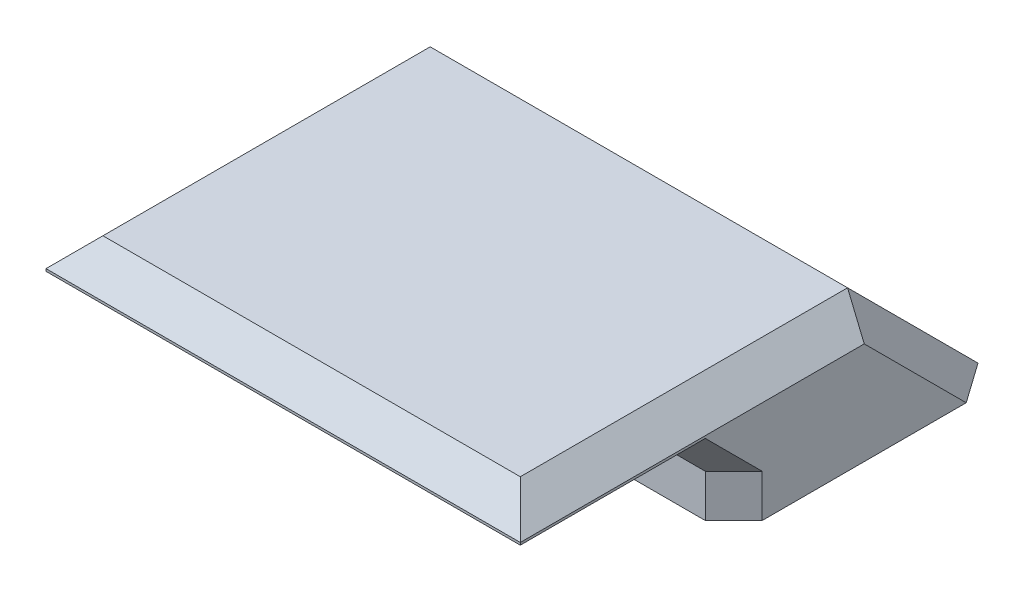
ISO-10303-21;
HEADER;
FILE_DESCRIPTION(('STEP AP214'),'2;1');
FILE_NAME('part.step','',(''),(''),'','','');
FILE_SCHEMA(('AUTOMOTIVE_DESIGN { 1 0 10303 214 1 1 1 1 }'));
ENDSEC;
DATA;
#1=APPLICATION_CONTEXT('core data for automotive mechanical design processes');
#2=APPLICATION_PROTOCOL_DEFINITION('international standard','automotive_design',2000,#1);
#3=PRODUCT_CONTEXT('',#1,'mechanical');
#4=PRODUCT('Part','Part','',(#3));
#5=PRODUCT_RELATED_PRODUCT_CATEGORY('part','',(#4));
#6=PRODUCT_DEFINITION_FORMATION('','',#4);
#7=PRODUCT_DEFINITION_CONTEXT('part definition',#1,'design');
#8=PRODUCT_DEFINITION('design','',#6,#7);
#9=PRODUCT_DEFINITION_SHAPE('','',#8);
#10=(LENGTH_UNIT() NAMED_UNIT(*) SI_UNIT(.MILLI.,.METRE.));
#11=(NAMED_UNIT(*) PLANE_ANGLE_UNIT() SI_UNIT($,.RADIAN.));
#12=(NAMED_UNIT(*) SI_UNIT($,.STERADIAN.) SOLID_ANGLE_UNIT());
#13=UNCERTAINTY_MEASURE_WITH_UNIT(LENGTH_MEASURE(1.E-05),#10,'distance_accuracy_value','');
#14=(GEOMETRIC_REPRESENTATION_CONTEXT(3) GLOBAL_UNCERTAINTY_ASSIGNED_CONTEXT((#13)) GLOBAL_UNIT_ASSIGNED_CONTEXT((#10,
#11,#12)) REPRESENTATION_CONTEXT('',''));
#15=CARTESIAN_POINT('',(0.,0.,0.));
#16=DIRECTION('',(0.,0.,1.));
#17=DIRECTION('',(1.,0.,0.));
#18=AXIS2_PLACEMENT_3D('',#15,#16,#17);
#19=CARTESIAN_POINT('',(-10.,3.,-3.));
#20=DIRECTION('',(1.,0.,0.));
#21=DIRECTION('',(0.,0.,-1.));
#22=AXIS2_PLACEMENT_3D('',#19,#20,#21);
#23=PLANE('',#22);
#24=DIRECTION('',(0.,0.,1.));
#25=VECTOR('',#24,1.);
#26=CARTESIAN_POINT('',(-10.,0.,-3.));
#27=LINE('',#26,#25);
#28=CARTESIAN_POINT('',(-10.,0.,-6.80294372515228));
#29=VERTEX_POINT('',#28);
#30=CARTESIAN_POINT('',(-9.99999999999999,0.,1.8));
#31=VERTEX_POINT('',#30);
#32=EDGE_CURVE('E341',#29,#31,#27,.T.);
#33=ORIENTED_EDGE('',*,*,#32,.T.);
#34=DIRECTION('',(0.,1.,0.));
#35=VECTOR('',#34,1.);
#36=CARTESIAN_POINT('',(-9.99999999999999,3.,1.8));
#37=LINE('',#36,#35);
#38=CARTESIAN_POINT('',(-9.99999999999999,1.8,1.8));
#39=VERTEX_POINT('',#38);
#40=EDGE_CURVE('E212',#31,#39,#37,.T.);
#41=ORIENTED_EDGE('',*,*,#40,.T.);
#42=DIRECTION('',(0.,-0.707106781186547,-0.707106781186548));
#43=VECTOR('',#42,1.);
#44=CARTESIAN_POINT('',(-9.99999999999999,1.8,1.8));
#45=LINE('',#44,#43);
#46=CARTESIAN_POINT('',(-9.99999999999999,3.,3.));
#47=VERTEX_POINT('',#46);
#48=EDGE_CURVE('E208',#47,#39,#45,.T.);
#49=ORIENTED_EDGE('',*,*,#48,.F.);
#50=DIRECTION('',(0.,-0.707106781186547,-0.707106781186548));
#51=VECTOR('',#50,1.);
#52=CARTESIAN_POINT('',(-9.99999999999999,1.8,1.8));
#53=LINE('',#52,#51);
#54=CARTESIAN_POINT('',(-9.99999999999999,4.2,4.2));
#55=VERTEX_POINT('',#54);
#56=EDGE_CURVE('E204',#55,#47,#53,.T.);
#57=ORIENTED_EDGE('',*,*,#56,.F.);
#58=DIRECTION('',(0.,0.,1.));
#59=VECTOR('',#58,1.);
#60=CARTESIAN_POINT('',(-10.,4.2,-3.));
#61=LINE('',#60,#59);
#62=CARTESIAN_POINT('',(-9.99999999999999,4.2,12.));
#63=VERTEX_POINT('',#62);
#64=EDGE_CURVE('E201',#55,#63,#61,.T.);
#65=ORIENTED_EDGE('',*,*,#64,.T.);
#66=DIRECTION('',(0.,-1.,0.));
#67=VECTOR('',#66,1.);
#68=CARTESIAN_POINT('',(-9.99999999999999,5.5,12.));
#69=LINE('',#68,#67);
#70=CARTESIAN_POINT('',(-9.99999999999999,4.3,12.));
#71=VERTEX_POINT('',#70);
#72=EDGE_CURVE('E318',#71,#63,#69,.T.);
#73=ORIENTED_EDGE('',*,*,#72,.F.);
#74=DIRECTION('',(0.,0.,-1.));
#75=VECTOR('',#74,1.);
#76=CARTESIAN_POINT('',(-10.,4.3,-3.));
#77=LINE('',#76,#75);
#78=CARTESIAN_POINT('',(-10.,4.3,-2.50294372515229));
#79=VERTEX_POINT('',#78);
#80=EDGE_CURVE('E194',#71,#79,#77,.T.);
#81=ORIENTED_EDGE('',*,*,#80,.T.);
#82=DIRECTION('',(0.,-0.707106781186548,-0.707106781186548));
#83=VECTOR('',#82,1.);
#84=CARTESIAN_POINT('',(-10.,-0.848528137423856,-7.65147186257614));
#85=LINE('',#84,#83);
#86=EDGE_CURVE('E197',#79,#29,#85,.T.);
#87=ORIENTED_EDGE('',*,*,#86,.T.);
#88=EDGE_LOOP('',(#33,#41,#49,#57,#65,#73,#81,#87));
#89=FACE_BOUND('',#88,.T.);
#90=ADVANCED_FACE('F39',(#89),#23,.F.);
#91=CARTESIAN_POINT('',(0.,0.,0.));
#92=DIRECTION('',(0.,1.,0.));
#93=DIRECTION('',(0.,0.,1.));
#94=AXIS2_PLACEMENT_3D('',#91,#92,#93);
#95=PLANE('',#94);
#96=DIRECTION('',(0.,0.,-1.));
#97=VECTOR('',#96,1.);
#98=CARTESIAN_POINT('',(10.,0.,-3.));
#99=LINE('',#98,#97);
#100=CARTESIAN_POINT('',(10.,0.,1.8));
#101=VERTEX_POINT('',#100);
#102=CARTESIAN_POINT('',(10.,0.,-6.80294372515228));
#103=VERTEX_POINT('',#102);
#104=EDGE_CURVE('E338',#101,#103,#99,.T.);
#105=ORIENTED_EDGE('',*,*,#104,.F.);
#106=DIRECTION('',(0.707106781186548,0.,-0.707106781186547));
#107=VECTOR('',#106,1.);
#108=CARTESIAN_POINT('',(10.,0.,1.8));
#109=LINE('',#108,#107);
#110=CARTESIAN_POINT('',(8.8,0.,3.));
#111=VERTEX_POINT('',#110);
#112=EDGE_CURVE('E182',#101,#111,#109,.F.);
#113=ORIENTED_EDGE('',*,*,#112,.T.);
#114=DIRECTION('',(1.,0.,0.));
#115=VECTOR('',#114,1.);
#116=CARTESIAN_POINT('',(-9.99999999999999,0.,3.));
#117=LINE('',#116,#115);
#118=CARTESIAN_POINT('',(-8.8,0.,3.));
#119=VERTEX_POINT('',#118);
#120=EDGE_CURVE('E345',#119,#111,#117,.T.);
#121=ORIENTED_EDGE('',*,*,#120,.F.);
#122=DIRECTION('',(0.707106781186548,0.,0.707106781186548));
#123=VECTOR('',#122,1.);
#124=CARTESIAN_POINT('',(-8.8,0.,3.));
#125=LINE('',#124,#123);
#126=EDGE_CURVE('E179',#119,#31,#125,.F.);
#127=ORIENTED_EDGE('',*,*,#126,.T.);
#128=ORIENTED_EDGE('',*,*,#32,.F.);
#129=DIRECTION('',(0.577350269189627,0.,-0.816496580927725));
#130=VECTOR('',#129,1.);
#131=CARTESIAN_POINT('',(-11.6034692133619,0.,-4.5352958167682));
#132=LINE('',#131,#130);
#133=CARTESIAN_POINT('',(-8.8,0.,-8.5));
#134=VERTEX_POINT('',#133);
#135=EDGE_CURVE('E176',#29,#134,#132,.T.);
#136=ORIENTED_EDGE('',*,*,#135,.T.);
#137=DIRECTION('',(-1.,0.,0.));
#138=VECTOR('',#137,1.);
#139=CARTESIAN_POINT('',(10.,0.,-8.5));
#140=LINE('',#139,#138);
#141=CARTESIAN_POINT('',(8.8,0.,-8.5));
#142=VERTEX_POINT('',#141);
#143=EDGE_CURVE('E272',#142,#134,#140,.T.);
#144=ORIENTED_EDGE('',*,*,#143,.F.);
#145=DIRECTION('',(0.577350269189624,0.,0.816496580927727));
#146=VECTOR('',#145,1.);
#147=CARTESIAN_POINT('',(11.3927248643507,0.,-4.83333333333333));
#148=LINE('',#147,#146);
#149=EDGE_CURVE('E173',#142,#103,#148,.T.);
#150=ORIENTED_EDGE('',*,*,#149,.T.);
#151=EDGE_LOOP('',(#105,#113,#121,#127,#128,#136,#144,#150));
#152=FACE_BOUND('',#151,.T.);
#153=CARTESIAN_POINT('',(-6.99999999999999,0.,0.));
#154=DIRECTION('',(0.,1.,0.));
#155=DIRECTION('',(0.,0.,1.));
#156=AXIS2_PLACEMENT_3D('',#153,#154,#155);
#157=CIRCLE('',#156,1.4);
#158=CARTESIAN_POINT('',(-6.99999999999999,0.,1.4));
#159=VERTEX_POINT('',#158);
#160=EDGE_CURVE('E331',#159,#159,#157,.T.);
#161=ORIENTED_EDGE('',*,*,#160,.T.);
#162=EDGE_LOOP('',(#161));
#163=FACE_BOUND('',#162,.T.);
#164=CARTESIAN_POINT('',(7.,0.,0.));
#165=DIRECTION('',(0.,1.,0.));
#166=DIRECTION('',(0.,0.,-1.));
#167=AXIS2_PLACEMENT_3D('',#164,#165,#166);
#168=CIRCLE('',#167,1.4);
#169=CARTESIAN_POINT('',(7.,0.,-1.4));
#170=VERTEX_POINT('',#169);
#171=EDGE_CURVE('E327',#170,#170,#168,.T.);
#172=ORIENTED_EDGE('',*,*,#171,.T.);
#173=EDGE_LOOP('',(#172));
#174=FACE_BOUND('',#173,.T.);
#175=ADVANCED_FACE('F306',(#152,#163,#174),#95,.F.);
#176=CARTESIAN_POINT('',(10.,3.,-3.));
#177=DIRECTION('',(-1.,0.,0.));
#178=DIRECTION('',(0.,0.,1.));
#179=AXIS2_PLACEMENT_3D('',#176,#177,#178);
#180=PLANE('',#179);
#181=DIRECTION('',(0.,0.707106781186547,0.707106781186548));
#182=VECTOR('',#181,1.);
#183=CARTESIAN_POINT('',(10.,4.2,4.2));
#184=LINE('',#183,#182);
#185=CARTESIAN_POINT('',(10.,1.8,1.8));
#186=VERTEX_POINT('',#185);
#187=CARTESIAN_POINT('',(10.,3.,3.));
#188=VERTEX_POINT('',#187);
#189=EDGE_CURVE('E148',#186,#188,#184,.T.);
#190=ORIENTED_EDGE('',*,*,#189,.F.);
#191=DIRECTION('',(0.,-1.,0.));
#192=VECTOR('',#191,1.);
#193=CARTESIAN_POINT('',(10.,3.,1.8));
#194=LINE('',#193,#192);
#195=EDGE_CURVE('E167',#186,#101,#194,.T.);
#196=ORIENTED_EDGE('',*,*,#195,.T.);
#197=ORIENTED_EDGE('',*,*,#104,.T.);
#198=DIRECTION('',(0.,0.707106781186548,0.707106781186548));
#199=VECTOR('',#198,1.);
#200=CARTESIAN_POINT('',(10.,4.65147186257614,-2.15147186257614));
#201=LINE('',#200,#199);
#202=CARTESIAN_POINT('',(10.,4.3,-2.50294372515229));
#203=VERTEX_POINT('',#202);
#204=EDGE_CURVE('E157',#103,#203,#201,.T.);
#205=ORIENTED_EDGE('',*,*,#204,.T.);
#206=DIRECTION('',(0.,0.,1.));
#207=VECTOR('',#206,1.);
#208=CARTESIAN_POINT('',(10.,4.3,12.));
#209=LINE('',#208,#207);
#210=CARTESIAN_POINT('',(10.,4.3,12.));
#211=VERTEX_POINT('',#210);
#212=EDGE_CURVE('E292',#203,#211,#209,.T.);
#213=ORIENTED_EDGE('',*,*,#212,.T.);
#214=DIRECTION('',(0.,-1.,0.));
#215=VECTOR('',#214,1.);
#216=CARTESIAN_POINT('',(10.,5.5,12.));
#217=LINE('',#216,#215);
#218=CARTESIAN_POINT('',(10.,4.2,12.));
#219=VERTEX_POINT('',#218);
#220=EDGE_CURVE('E313',#211,#219,#217,.T.);
#221=ORIENTED_EDGE('',*,*,#220,.T.);
#222=DIRECTION('',(0.,0.,-1.));
#223=VECTOR('',#222,1.);
#224=CARTESIAN_POINT('',(10.,4.2,-3.));
#225=LINE('',#224,#223);
#226=CARTESIAN_POINT('',(10.,4.2,4.2));
#227=VERTEX_POINT('',#226);
#228=EDGE_CURVE('E152',#219,#227,#225,.T.);
#229=ORIENTED_EDGE('',*,*,#228,.T.);
#230=DIRECTION('',(0.,0.707106781186547,0.707106781186548));
#231=VECTOR('',#230,1.);
#232=CARTESIAN_POINT('',(10.,4.2,4.2));
#233=LINE('',#232,#231);
#234=EDGE_CURVE('E144',#188,#227,#233,.T.);
#235=ORIENTED_EDGE('',*,*,#234,.F.);
#236=EDGE_LOOP('',(#190,#196,#197,#205,#213,#221,#229,#235));
#237=FACE_BOUND('',#236,.T.);
#238=ADVANCED_FACE('F146',(#237),#180,.F.);
#239=CARTESIAN_POINT('',(-9.99999999999999,3.,3.));
#240=DIRECTION('',(0.,0.,-1.));
#241=DIRECTION('',(-1.,0.,0.));
#242=AXIS2_PLACEMENT_3D('',#239,#240,#241);
#243=PLANE('',#242);
#244=ORIENTED_EDGE('',*,*,#120,.T.);
#245=DIRECTION('',(0.,1.,0.));
#246=VECTOR('',#245,1.);
#247=CARTESIAN_POINT('',(8.8,3.,3.));
#248=LINE('',#247,#246);
#249=CARTESIAN_POINT('',(8.8,1.8,3.));
#250=VERTEX_POINT('',#249);
#251=EDGE_CURVE('E191',#111,#250,#248,.T.);
#252=ORIENTED_EDGE('',*,*,#251,.T.);
#253=DIRECTION('',(-1.,0.,0.));
#254=VECTOR('',#253,1.);
#255=CARTESIAN_POINT('',(-9.99999999999999,1.8,3.));
#256=LINE('',#255,#254);
#257=CARTESIAN_POINT('',(-8.8,1.8,3.));
#258=VERTEX_POINT('',#257);
#259=EDGE_CURVE('E185',#250,#258,#256,.T.);
#260=ORIENTED_EDGE('',*,*,#259,.T.);
#261=DIRECTION('',(0.,-1.,0.));
#262=VECTOR('',#261,1.);
#263=CARTESIAN_POINT('',(-8.8,3.,3.));
#264=LINE('',#263,#262);
#265=EDGE_CURVE('E188',#258,#119,#264,.T.);
#266=ORIENTED_EDGE('',*,*,#265,.T.);
#267=EDGE_LOOP('',(#244,#252,#260,#266));
#268=FACE_BOUND('',#267,.T.);
#269=ADVANCED_FACE('F357',(#268),#243,.F.);
#270=CARTESIAN_POINT('',(-6.99999999999999,3.,0.));
#271=DIRECTION('',(0.,-1.,0.));
#272=DIRECTION('',(0.,0.,-1.));
#273=AXIS2_PLACEMENT_3D('',#270,#271,#272);
#274=CYLINDRICAL_SURFACE('',#273,1.4);
#275=CARTESIAN_POINT('',(-6.99999999999999,3.,0.));
#276=DIRECTION('',(0.,1.,0.));
#277=DIRECTION('',(0.,0.,1.));
#278=AXIS2_PLACEMENT_3D('',#275,#276,#277);
#279=CIRCLE('',#278,1.4);
#280=CARTESIAN_POINT('',(-6.99999999999999,3.,1.4));
#281=VERTEX_POINT('',#280);
#282=EDGE_CURVE('E326',#281,#281,#279,.T.);
#283=ORIENTED_EDGE('',*,*,#282,.T.);
#284=EDGE_LOOP('',(#283));
#285=FACE_BOUND('',#284,.T.);
#286=ORIENTED_EDGE('',*,*,#160,.F.);
#287=EDGE_LOOP('',(#286));
#288=FACE_BOUND('',#287,.T.);
#289=ADVANCED_FACE('F382',(#285,#288),#274,.F.);
#290=CARTESIAN_POINT('',(7.,3.,0.));
#291=DIRECTION('',(0.,-1.,0.));
#292=DIRECTION('',(0.,0.,-1.));
#293=AXIS2_PLACEMENT_3D('',#290,#291,#292);
#294=CYLINDRICAL_SURFACE('',#293,1.4);
#295=CARTESIAN_POINT('',(7.,3.,0.));
#296=DIRECTION('',(0.,1.,0.));
#297=DIRECTION('',(0.,0.,-1.));
#298=AXIS2_PLACEMENT_3D('',#295,#296,#297);
#299=CIRCLE('',#298,1.4);
#300=CARTESIAN_POINT('',(7.,3.,-1.4));
#301=VERTEX_POINT('',#300);
#302=EDGE_CURVE('E322',#301,#301,#299,.T.);
#303=ORIENTED_EDGE('',*,*,#302,.T.);
#304=EDGE_LOOP('',(#303));
#305=FACE_BOUND('',#304,.T.);
#306=ORIENTED_EDGE('',*,*,#171,.F.);
#307=EDGE_LOOP('',(#306));
#308=FACE_BOUND('',#307,.T.);
#309=ADVANCED_FACE('F386',(#305,#308),#294,.F.);
#310=CARTESIAN_POINT('',(0.,3.,0.));
#311=DIRECTION('',(0.,1.,0.));
#312=DIRECTION('',(0.,0.,1.));
#313=AXIS2_PLACEMENT_3D('',#310,#311,#312);
#314=PLANE('',#313);
#315=ORIENTED_EDGE('',*,*,#302,.F.);
#316=EDGE_LOOP('',(#315));
#317=FACE_BOUND('',#316,.T.);
#318=ADVANCED_FACE('F392',(#317),#314,.F.);
#319=DIRECTION('',(1.,0.,0.));
#320=VECTOR('',#319,1.);
#321=CARTESIAN_POINT('',(10.,3.,4.2));
#322=LINE('',#321,#320);
#323=CARTESIAN_POINT('',(-8.8,3.,4.2));
#324=VERTEX_POINT('',#323);
#325=CARTESIAN_POINT('',(8.8,3.,4.2));
#326=VERTEX_POINT('',#325);
#327=EDGE_CURVE('E221',#324,#326,#322,.T.);
#328=ORIENTED_EDGE('',*,*,#327,.T.);
#329=DIRECTION('',(0.,0.,1.));
#330=VECTOR('',#329,1.);
#331=CARTESIAN_POINT('',(8.8,3.,0.));
#332=LINE('',#331,#330);
#333=CARTESIAN_POINT('',(8.8,3.,10.8));
#334=VERTEX_POINT('',#333);
#335=EDGE_CURVE('E224',#326,#334,#332,.T.);
#336=ORIENTED_EDGE('',*,*,#335,.T.);
#337=DIRECTION('',(-1.,0.,0.));
#338=VECTOR('',#337,1.);
#339=CARTESIAN_POINT('',(0.,3.,10.8));
#340=LINE('',#339,#338);
#341=CARTESIAN_POINT('',(-8.79999999999999,3.,10.8));
#342=VERTEX_POINT('',#341);
#343=EDGE_CURVE('E215',#334,#342,#340,.T.);
#344=ORIENTED_EDGE('',*,*,#343,.T.);
#345=DIRECTION('',(0.,0.,-1.));
#346=VECTOR('',#345,1.);
#347=CARTESIAN_POINT('',(-8.8,3.,0.));
#348=LINE('',#347,#346);
#349=EDGE_CURVE('E218',#342,#324,#348,.T.);
#350=ORIENTED_EDGE('',*,*,#349,.T.);
#351=EDGE_LOOP('',(#328,#336,#344,#350));
#352=FACE_BOUND('',#351,.T.);
#353=ADVANCED_FACE('F403',(#352),#314,.F.);
#354=CARTESIAN_POINT('',(0.,5.5,0.));
#355=DIRECTION('',(0.,1.,0.));
#356=DIRECTION('',(0.,0.,1.));
#357=AXIS2_PLACEMENT_3D('',#354,#355,#356);
#358=PLANE('',#357);
#359=DIRECTION('',(-1.,0.,0.));
#360=VECTOR('',#359,1.);
#361=CARTESIAN_POINT('',(-10.,5.5,-3.));
#362=LINE('',#361,#360);
#363=CARTESIAN_POINT('',(8.8,5.5,-3.));
#364=VERTEX_POINT('',#363);
#365=CARTESIAN_POINT('',(-8.8,5.5,-3.));
#366=VERTEX_POINT('',#365);
#367=EDGE_CURVE('E303',#364,#366,#362,.T.);
#368=ORIENTED_EDGE('',*,*,#367,.T.);
#369=DIRECTION('',(0.,0.,1.));
#370=VECTOR('',#369,1.);
#371=CARTESIAN_POINT('',(-8.79999999999999,5.5,12.));
#372=LINE('',#371,#370);
#373=CARTESIAN_POINT('',(-8.79999999999999,5.5,10.8));
#374=VERTEX_POINT('',#373);
#375=EDGE_CURVE('E11',#366,#374,#372,.T.);
#376=ORIENTED_EDGE('',*,*,#375,.T.);
#377=DIRECTION('',(1.,0.,0.));
#378=VECTOR('',#377,1.);
#379=CARTESIAN_POINT('',(10.,5.5,10.8));
#380=LINE('',#379,#378);
#381=CARTESIAN_POINT('',(8.8,5.5,10.8));
#382=VERTEX_POINT('',#381);
#383=EDGE_CURVE('E49',#374,#382,#380,.T.);
#384=ORIENTED_EDGE('',*,*,#383,.T.);
#385=DIRECTION('',(0.,0.,-1.));
#386=VECTOR('',#385,1.);
#387=CARTESIAN_POINT('',(8.8,5.5,-3.));
#388=LINE('',#387,#386);
#389=EDGE_CURVE('E240',#382,#364,#388,.T.);
#390=ORIENTED_EDGE('',*,*,#389,.T.);
#391=EDGE_LOOP('',(#368,#376,#384,#390));
#392=FACE_BOUND('',#391,.T.);
#393=ADVANCED_FACE('F401',(#392),#358,.T.);
#394=CARTESIAN_POINT('',(-9.99999999999999,5.5,12.));
#395=DIRECTION('',(0.,0.,-1.));
#396=DIRECTION('',(-1.,0.,0.));
#397=AXIS2_PLACEMENT_3D('',#394,#395,#396);
#398=PLANE('',#397);
#399=ORIENTED_EDGE('',*,*,#72,.T.);
#400=DIRECTION('',(1.,0.,0.));
#401=VECTOR('',#400,1.);
#402=CARTESIAN_POINT('',(-9.99999999999999,4.2,12.));
#403=LINE('',#402,#401);
#404=EDGE_CURVE('E231',#63,#219,#403,.T.);
#405=ORIENTED_EDGE('',*,*,#404,.T.);
#406=ORIENTED_EDGE('',*,*,#220,.F.);
#407=DIRECTION('',(-1.,0.,0.));
#408=VECTOR('',#407,1.);
#409=CARTESIAN_POINT('',(-9.99999999999999,4.3,12.));
#410=LINE('',#409,#408);
#411=EDGE_CURVE('E228',#211,#71,#410,.T.);
#412=ORIENTED_EDGE('',*,*,#411,.T.);
#413=EDGE_LOOP('',(#399,#405,#406,#412));
#414=FACE_BOUND('',#413,.T.);
#415=ADVANCED_FACE('F397',(#414),#398,.F.);
#416=ORIENTED_EDGE('',*,*,#282,.F.);
#417=EDGE_LOOP('',(#416));
#418=FACE_BOUND('',#417,.T.);
#419=ADVANCED_FACE('F400',(#418),#314,.F.);
#420=CARTESIAN_POINT('',(10.,5.5,-3.00000000000001));
#421=DIRECTION('',(0.,0.707106781186548,-0.707106781186548));
#422=DIRECTION('',(0.,0.707106781186548,0.707106781186548));
#423=AXIS2_PLACEMENT_3D('',#420,#421,#422);
#424=PLANE('',#423);
#425=ORIENTED_EDGE('',*,*,#143,.T.);
#426=DIRECTION('',(0.,0.707106781186548,0.707106781186548));
#427=VECTOR('',#426,1.);
#428=CARTESIAN_POINT('',(-8.79999999999999,5.5,-3.));
#429=LINE('',#428,#427);
#430=EDGE_CURVE('E237',#134,#366,#429,.T.);
#431=ORIENTED_EDGE('',*,*,#430,.T.);
#432=ORIENTED_EDGE('',*,*,#367,.F.);
#433=DIRECTION('',(0.,-0.707106781186548,-0.707106781186548));
#434=VECTOR('',#433,1.);
#435=CARTESIAN_POINT('',(8.8,0.,-8.5));
#436=LINE('',#435,#434);
#437=EDGE_CURVE('E234',#364,#142,#436,.T.);
#438=ORIENTED_EDGE('',*,*,#437,.T.);
#439=EDGE_LOOP('',(#425,#431,#432,#438));
#440=FACE_BOUND('',#439,.T.);
#441=ADVANCED_FACE('F301',(#440),#424,.T.);
#442=CARTESIAN_POINT('',(-8.8,3.,3.));
#443=DIRECTION('',(0.707106781186547,0.,-0.707106781186547));
#444=DIRECTION('',(0.,-1.,0.));
#445=AXIS2_PLACEMENT_3D('',#442,#443,#444);
#446=PLANE('',#445);
#447=ORIENTED_EDGE('',*,*,#126,.F.);
#448=ORIENTED_EDGE('',*,*,#265,.F.);
#449=DIRECTION('',(0.707106781186547,0.,0.707106781186548));
#450=VECTOR('',#449,1.);
#451=CARTESIAN_POINT('',(-9.99999999999999,1.8,1.8));
#452=LINE('',#451,#450);
#453=EDGE_CURVE('E268',#39,#258,#452,.T.);
#454=ORIENTED_EDGE('',*,*,#453,.F.);
#455=ORIENTED_EDGE('',*,*,#40,.F.);
#456=EDGE_LOOP('',(#447,#448,#454,#455));
#457=FACE_BOUND('',#456,.T.);
#458=ADVANCED_FACE('F410',(#457),#446,.F.);
#459=CARTESIAN_POINT('',(-10.,4.2,-3.));
#460=DIRECTION('',(0.707106781186547,0.707106781186548,0.));
#461=DIRECTION('',(0.,0.,1.));
#462=AXIS2_PLACEMENT_3D('',#459,#460,#461);
#463=PLANE('',#462);
#464=DIRECTION('',(0.577350269189626,-0.577350269189626,-0.577350269189626));
#465=VECTOR('',#464,1.);
#466=CARTESIAN_POINT('',(-9.99999999999999,4.2,12.));
#467=LINE('',#466,#465);
#468=EDGE_CURVE('E260',#63,#342,#467,.T.);
#469=ORIENTED_EDGE('',*,*,#468,.F.);
#470=ORIENTED_EDGE('',*,*,#64,.F.);
#471=DIRECTION('',(-0.707106781186547,0.707106781186547,0.));
#472=VECTOR('',#471,1.);
#473=CARTESIAN_POINT('',(-8.8,3.,4.2));
#474=LINE('',#473,#472);
#475=EDGE_CURVE('E264',#324,#55,#474,.T.);
#476=ORIENTED_EDGE('',*,*,#475,.F.);
#477=ORIENTED_EDGE('',*,*,#349,.F.);
#478=EDGE_LOOP('',(#469,#470,#476,#477));
#479=FACE_BOUND('',#478,.T.);
#480=ADVANCED_FACE('F415',(#479),#463,.F.);
#481=CARTESIAN_POINT('',(-8.8,1.8,3.));
#482=DIRECTION('',(-0.577350269189626,-0.577350269189626,0.577350269189626));
#483=DIRECTION('',(0.707106781186548,-0.707106781186548,0.));
#484=AXIS2_PLACEMENT_3D('',#481,#482,#483);
#485=PLANE('',#484);
#486=ORIENTED_EDGE('',*,*,#48,.T.);
#487=ORIENTED_EDGE('',*,*,#453,.T.);
#488=DIRECTION('',(0.,-0.707106781186547,-0.707106781186548));
#489=VECTOR('',#488,1.);
#490=CARTESIAN_POINT('',(-8.8,1.8,3.));
#491=LINE('',#490,#489);
#492=EDGE_CURVE('E256',#324,#258,#491,.T.);
#493=ORIENTED_EDGE('',*,*,#492,.F.);
#494=ORIENTED_EDGE('',*,*,#475,.T.);
#495=ORIENTED_EDGE('',*,*,#56,.T.);
#496=EDGE_LOOP('',(#486,#487,#493,#494,#495));
#497=FACE_BOUND('',#496,.T.);
#498=ADVANCED_FACE('F467',(#497),#485,.T.);
#499=CARTESIAN_POINT('',(-9.99999999999999,4.2,12.));
#500=DIRECTION('',(0.,0.707106781186547,-0.707106781186547));
#501=DIRECTION('',(1.,0.,0.));
#502=AXIS2_PLACEMENT_3D('',#499,#500,#501);
#503=PLANE('',#502);
#504=ORIENTED_EDGE('',*,*,#468,.T.);
#505=ORIENTED_EDGE('',*,*,#343,.F.);
#506=DIRECTION('',(0.577350269189626,0.577350269189626,0.577350269189626));
#507=VECTOR('',#506,1.);
#508=CARTESIAN_POINT('',(3.33333333333334,-2.46666666666667,5.33333333333333));
#509=LINE('',#508,#507);
#510=EDGE_CURVE('E253',#219,#334,#509,.F.);
#511=ORIENTED_EDGE('',*,*,#510,.F.);
#512=ORIENTED_EDGE('',*,*,#404,.F.);
#513=EDGE_LOOP('',(#504,#505,#511,#512));
#514=FACE_BOUND('',#513,.T.);
#515=ADVANCED_FACE('F477',(#514),#503,.F.);
#516=CARTESIAN_POINT('',(0.,3.,4.2));
#517=DIRECTION('',(0.,-0.707106781186548,0.707106781186547));
#518=DIRECTION('',(-1.,0.,0.));
#519=AXIS2_PLACEMENT_3D('',#516,#517,#518);
#520=PLANE('',#519);
#521=ORIENTED_EDGE('',*,*,#492,.T.);
#522=ORIENTED_EDGE('',*,*,#259,.F.);
#523=DIRECTION('',(0.,0.707106781186547,0.707106781186548));
#524=VECTOR('',#523,1.);
#525=CARTESIAN_POINT('',(8.8,3.,4.2));
#526=LINE('',#525,#524);
#527=EDGE_CURVE('E250',#326,#250,#526,.F.);
#528=ORIENTED_EDGE('',*,*,#527,.F.);
#529=ORIENTED_EDGE('',*,*,#327,.F.);
#530=EDGE_LOOP('',(#521,#522,#528,#529));
#531=FACE_BOUND('',#530,.T.);
#532=ADVANCED_FACE('F487',(#531),#520,.T.);
#533=CARTESIAN_POINT('',(10.,4.2,-3.));
#534=DIRECTION('',(-0.707106781186547,0.707106781186547,0.));
#535=DIRECTION('',(0.,0.,-1.));
#536=AXIS2_PLACEMENT_3D('',#533,#534,#535);
#537=PLANE('',#536);
#538=ORIENTED_EDGE('',*,*,#510,.T.);
#539=ORIENTED_EDGE('',*,*,#335,.F.);
#540=DIRECTION('',(-0.707106781186547,-0.707106781186547,0.));
#541=VECTOR('',#540,1.);
#542=CARTESIAN_POINT('',(10.,4.2,4.2));
#543=LINE('',#542,#541);
#544=EDGE_CURVE('E247',#227,#326,#543,.T.);
#545=ORIENTED_EDGE('',*,*,#544,.F.);
#546=ORIENTED_EDGE('',*,*,#228,.F.);
#547=EDGE_LOOP('',(#538,#539,#545,#546));
#548=FACE_BOUND('',#547,.T.);
#549=ADVANCED_FACE('F367',(#548),#537,.F.);
#550=CARTESIAN_POINT('',(8.8,3.,4.2));
#551=DIRECTION('',(0.577350269189626,-0.577350269189626,0.577350269189625));
#552=DIRECTION('',(0.707106781186547,0.707106781186547,0.));
#553=AXIS2_PLACEMENT_3D('',#550,#551,#552);
#554=PLANE('',#553);
#555=ORIENTED_EDGE('',*,*,#544,.T.);
#556=ORIENTED_EDGE('',*,*,#527,.T.);
#557=DIRECTION('',(0.707106781186548,0.,-0.707106781186547));
#558=VECTOR('',#557,1.);
#559=CARTESIAN_POINT('',(8.8,1.8,3.));
#560=LINE('',#559,#558);
#561=EDGE_CURVE('E162',#186,#250,#560,.F.);
#562=ORIENTED_EDGE('',*,*,#561,.F.);
#563=ORIENTED_EDGE('',*,*,#189,.T.);
#564=ORIENTED_EDGE('',*,*,#234,.T.);
#565=EDGE_LOOP('',(#555,#556,#562,#563,#564));
#566=FACE_BOUND('',#565,.T.);
#567=ADVANCED_FACE('F159',(#566),#554,.T.);
#568=CARTESIAN_POINT('',(10.,3.,1.8));
#569=DIRECTION('',(-0.707106781186547,0.,-0.707106781186548));
#570=DIRECTION('',(0.,-1.,0.));
#571=AXIS2_PLACEMENT_3D('',#568,#569,#570);
#572=PLANE('',#571);
#573=ORIENTED_EDGE('',*,*,#561,.T.);
#574=ORIENTED_EDGE('',*,*,#251,.F.);
#575=ORIENTED_EDGE('',*,*,#112,.F.);
#576=ORIENTED_EDGE('',*,*,#195,.F.);
#577=EDGE_LOOP('',(#573,#574,#575,#576));
#578=FACE_BOUND('',#577,.T.);
#579=ADVANCED_FACE('F360',(#578),#572,.F.);
#580=CARTESIAN_POINT('',(8.8,5.5,-3.00000000000001));
#581=DIRECTION('',(0.707106781186549,0.499999999999999,-0.499999999999999));
#582=DIRECTION('',(0.,0.707106781186548,0.707106781186548));
#583=AXIS2_PLACEMENT_3D('',#580,#581,#582);
#584=PLANE('',#583);
#585=ORIENTED_EDGE('',*,*,#149,.F.);
#586=ORIENTED_EDGE('',*,*,#437,.F.);
#587=DIRECTION('',(-0.678598344545846,0.678598344545848,-0.281084637714821));
#588=VECTOR('',#587,1.);
#589=CARTESIAN_POINT('',(9.37223070949164,4.92776929050836,-2.76297427932219));
#590=LINE('',#589,#588);
#591=EDGE_CURVE('E43',#203,#364,#590,.T.);
#592=ORIENTED_EDGE('',*,*,#591,.F.);
#593=ORIENTED_EDGE('',*,*,#204,.F.);
#594=EDGE_LOOP('',(#585,#586,#592,#593));
#595=FACE_BOUND('',#594,.T.);
#596=ADVANCED_FACE('F41',(#595),#584,.T.);
#597=CARTESIAN_POINT('',(8.8,5.5,0.));
#598=DIRECTION('',(0.707106781186549,0.707106781186547,0.));
#599=DIRECTION('',(0.,0.,1.));
#600=AXIS2_PLACEMENT_3D('',#597,#598,#599);
#601=PLANE('',#600);
#602=ORIENTED_EDGE('',*,*,#591,.T.);
#603=ORIENTED_EDGE('',*,*,#389,.F.);
#604=DIRECTION('',(0.577350269189625,-0.577350269189627,0.577350269189625));
#605=VECTOR('',#604,1.);
#606=CARTESIAN_POINT('',(5.20000000000001,9.1,7.20000000000001));
#607=LINE('',#606,#605);
#608=EDGE_CURVE('E280',#211,#382,#607,.F.);
#609=ORIENTED_EDGE('',*,*,#608,.F.);
#610=ORIENTED_EDGE('',*,*,#212,.F.);
#611=EDGE_LOOP('',(#602,#603,#609,#610));
#612=FACE_BOUND('',#611,.T.);
#613=ADVANCED_FACE('F291',(#612),#601,.T.);
#614=CARTESIAN_POINT('',(0.,5.5,10.8));
#615=DIRECTION('',(0.,0.707106781186547,0.707106781186549));
#616=DIRECTION('',(-1.,0.,0.));
#617=AXIS2_PLACEMENT_3D('',#614,#615,#616);
#618=PLANE('',#617);
#619=ORIENTED_EDGE('',*,*,#608,.T.);
#620=ORIENTED_EDGE('',*,*,#383,.F.);
#621=DIRECTION('',(-0.577350269189625,-0.577350269189627,0.577350269189625));
#622=VECTOR('',#621,1.);
#623=CARTESIAN_POINT('',(-5.86666666666667,8.43333333333333,7.86666666666667));
#624=LINE('',#623,#622);
#625=EDGE_CURVE('E277',#71,#374,#624,.F.);
#626=ORIENTED_EDGE('',*,*,#625,.F.);
#627=ORIENTED_EDGE('',*,*,#411,.F.);
#628=EDGE_LOOP('',(#619,#620,#626,#627));
#629=FACE_BOUND('',#628,.T.);
#630=ADVANCED_FACE('F531',(#629),#618,.T.);
#631=CARTESIAN_POINT('',(-8.8,5.5,0.));
#632=DIRECTION('',(-0.707106781186548,0.707106781186547,0.));
#633=DIRECTION('',(0.,0.,-1.));
#634=AXIS2_PLACEMENT_3D('',#631,#632,#633);
#635=PLANE('',#634);
#636=ORIENTED_EDGE('',*,*,#625,.T.);
#637=ORIENTED_EDGE('',*,*,#375,.F.);
#638=DIRECTION('',(-0.678598344545847,-0.678598344545849,0.281084637714815));
#639=VECTOR('',#638,1.);
#640=CARTESIAN_POINT('',(-9.37223070949162,4.92776929050837,-2.76297427932219));
#641=LINE('',#640,#639);
#642=EDGE_CURVE('E273',#79,#366,#641,.F.);
#643=ORIENTED_EDGE('',*,*,#642,.F.);
#644=ORIENTED_EDGE('',*,*,#80,.F.);
#645=EDGE_LOOP('',(#636,#637,#643,#644));
#646=FACE_BOUND('',#645,.T.);
#647=ADVANCED_FACE('F539',(#646),#635,.T.);
#648=CARTESIAN_POINT('',(-10.,3.40147186257614,-3.40147186257614));
#649=DIRECTION('',(-0.707106781186546,0.500000000000001,-0.500000000000001));
#650=DIRECTION('',(0.,0.707106781186548,0.707106781186548));
#651=AXIS2_PLACEMENT_3D('',#648,#649,#650);
#652=PLANE('',#651);
#653=ORIENTED_EDGE('',*,*,#642,.T.);
#654=ORIENTED_EDGE('',*,*,#430,.F.);
#655=ORIENTED_EDGE('',*,*,#135,.F.);
#656=ORIENTED_EDGE('',*,*,#86,.F.);
#657=EDGE_LOOP('',(#653,#654,#655,#656));
#658=FACE_BOUND('',#657,.T.);
#659=ADVANCED_FACE('F548',(#658),#652,.T.);
#660=CLOSED_SHELL('',(#90,#175,#238,#269,#289,#309,#318,#353,#393,#415,#419,#441,#458,#480,#498,
#515,#532,#549,#567,#579,#596,#613,#630,#647,#659));
#661=MANIFOLD_SOLID_BREP('B2',#660);
#662=ADVANCED_BREP_SHAPE_REPRESENTATION('',(#18,#661),#14);
#663=SHAPE_DEFINITION_REPRESENTATION(#9,#662);
ENDSEC;
END-ISO-10303-21;
